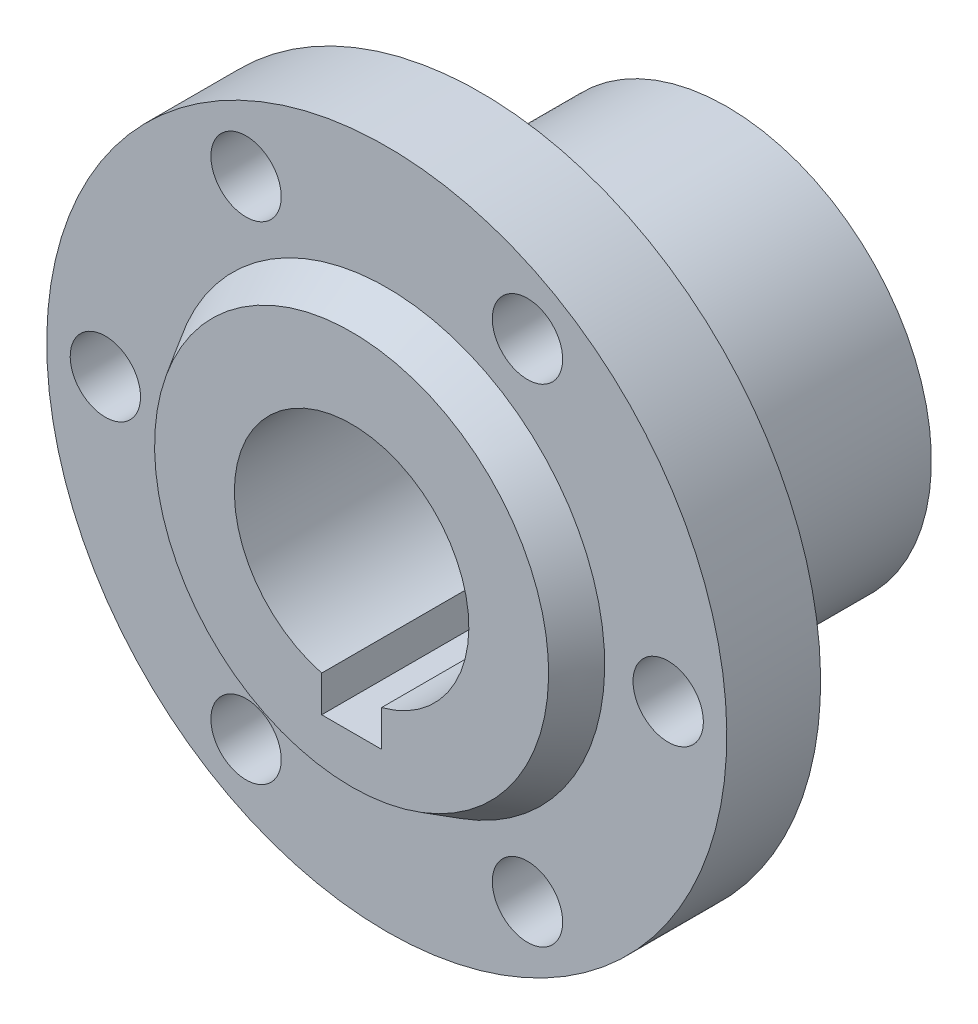
ISO-10303-21;
HEADER;
FILE_DESCRIPTION(('STEP AP214'),'2;1');
FILE_NAME('part.step','',(''),(''),'','','');
FILE_SCHEMA(('AUTOMOTIVE_DESIGN { 1 0 10303 214 1 1 1 1 }'));
ENDSEC;
DATA;
#1=APPLICATION_CONTEXT('core data for automotive mechanical design processes');
#2=APPLICATION_PROTOCOL_DEFINITION('international standard','automotive_design',2000,#1);
#3=PRODUCT_CONTEXT('',#1,'mechanical');
#4=PRODUCT('Part','Part','',(#3));
#5=PRODUCT_RELATED_PRODUCT_CATEGORY('part','',(#4));
#6=PRODUCT_DEFINITION_FORMATION('','',#4);
#7=PRODUCT_DEFINITION_CONTEXT('part definition',#1,'design');
#8=PRODUCT_DEFINITION('design','',#6,#7);
#9=PRODUCT_DEFINITION_SHAPE('','',#8);
#10=(LENGTH_UNIT() NAMED_UNIT(*) SI_UNIT(.MILLI.,.METRE.));
#11=(NAMED_UNIT(*) PLANE_ANGLE_UNIT() SI_UNIT($,.RADIAN.));
#12=(NAMED_UNIT(*) SI_UNIT($,.STERADIAN.) SOLID_ANGLE_UNIT());
#13=UNCERTAINTY_MEASURE_WITH_UNIT(LENGTH_MEASURE(1.E-05),#10,'distance_accuracy_value','');
#14=(GEOMETRIC_REPRESENTATION_CONTEXT(3) GLOBAL_UNCERTAINTY_ASSIGNED_CONTEXT((#13)) GLOBAL_UNIT_ASSIGNED_CONTEXT((#10,
#11,#12)) REPRESENTATION_CONTEXT('',''));
#15=CARTESIAN_POINT('',(0.,0.,0.));
#16=DIRECTION('',(0.,0.,1.));
#17=DIRECTION('',(1.,0.,0.));
#18=AXIS2_PLACEMENT_3D('',#15,#16,#17);
#19=CARTESIAN_POINT('',(0.,10.,-21.));
#20=DIRECTION('',(0.,0.,1.));
#21=DIRECTION('',(0.,-1.,0.));
#22=AXIS2_PLACEMENT_3D('',#19,#20,#21);
#23=PLANE('',#22);
#24=CARTESIAN_POINT('',(0.,0.,-21.));
#25=DIRECTION('',(0.,0.,1.));
#26=DIRECTION('',(0.,-1.,0.));
#27=AXIS2_PLACEMENT_3D('',#24,#25,#26);
#28=CIRCLE('',#27,17.45);
#29=CARTESIAN_POINT('',(0.,-17.45,-21.));
#30=VERTEX_POINT('',#29);
#31=EDGE_CURVE('E11',#30,#30,#28,.T.);
#32=ORIENTED_EDGE('',*,*,#31,.F.);
#33=EDGE_LOOP('',(#32));
#34=FACE_BOUND('',#33,.T.);
#35=DIRECTION('',(1.,0.,0.));
#36=VECTOR('',#35,1.);
#37=CARTESIAN_POINT('',(-2.55,-12.75,-21.));
#38=LINE('',#37,#36);
#39=CARTESIAN_POINT('',(-2.55,-12.75,-21.));
#40=VERTEX_POINT('',#39);
#41=CARTESIAN_POINT('',(2.55,-12.75,-21.));
#42=VERTEX_POINT('',#41);
#43=EDGE_CURVE('E159',#40,#42,#38,.T.);
#44=ORIENTED_EDGE('',*,*,#43,.T.);
#45=DIRECTION('',(0.,1.,0.));
#46=VECTOR('',#45,1.);
#47=CARTESIAN_POINT('',(2.55,-12.75,-21.));
#48=LINE('',#47,#46);
#49=CARTESIAN_POINT('',(2.55,-9.66941053012023,-21.));
#50=VERTEX_POINT('',#49);
#51=EDGE_CURVE('E87',#42,#50,#48,.T.);
#52=ORIENTED_EDGE('',*,*,#51,.T.);
#53=CARTESIAN_POINT('',(0.,0.,-21.));
#54=DIRECTION('',(0.,0.,1.));
#55=DIRECTION('',(0.,-1.,0.));
#56=AXIS2_PLACEMENT_3D('',#53,#54,#55);
#57=CIRCLE('',#56,10.);
#58=CARTESIAN_POINT('',(-2.55,-9.66941053012023,-21.));
#59=VERTEX_POINT('',#58);
#60=EDGE_CURVE('E101',#50,#59,#57,.T.);
#61=ORIENTED_EDGE('',*,*,#60,.T.);
#62=DIRECTION('',(0.,-1.,0.));
#63=VECTOR('',#62,1.);
#64=CARTESIAN_POINT('',(-2.55,-12.75,-21.));
#65=LINE('',#64,#63);
#66=EDGE_CURVE('E52',#59,#40,#65,.T.);
#67=ORIENTED_EDGE('',*,*,#66,.T.);
#68=EDGE_LOOP('',(#44,#52,#61,#67));
#69=FACE_BOUND('',#68,.T.);
#70=ADVANCED_FACE('F36',(#34,#69),#23,.F.);
#71=CARTESIAN_POINT('',(0.,0.,11.));
#72=DIRECTION('',(0.,0.,1.));
#73=DIRECTION('',(0.,-1.,0.));
#74=AXIS2_PLACEMENT_3D('',#71,#72,#73);
#75=CYLINDRICAL_SURFACE('',#74,17.45);
#76=CARTESIAN_POINT('',(0.,0.,-7.03));
#77=DIRECTION('',(0.,0.,1.));
#78=DIRECTION('',(0.,-1.,0.));
#79=AXIS2_PLACEMENT_3D('',#76,#77,#78);
#80=CIRCLE('',#79,17.45);
#81=CARTESIAN_POINT('',(0.,-17.45,-7.03));
#82=VERTEX_POINT('',#81);
#83=EDGE_CURVE('E44',#82,#82,#80,.T.);
#84=ORIENTED_EDGE('',*,*,#83,.F.);
#85=EDGE_LOOP('',(#84));
#86=FACE_BOUND('',#85,.T.);
#87=ORIENTED_EDGE('',*,*,#31,.T.);
#88=EDGE_LOOP('',(#87));
#89=FACE_BOUND('',#88,.T.);
#90=ADVANCED_FACE('F181',(#86,#89),#75,.T.);
#91=CARTESIAN_POINT('',(0.,17.45,-7.03));
#92=DIRECTION('',(0.,0.,1.));
#93=DIRECTION('',(0.,-1.,0.));
#94=AXIS2_PLACEMENT_3D('',#91,#92,#93);
#95=PLANE('',#94);
#96=CARTESIAN_POINT('',(0.,0.,-7.03));
#97=DIRECTION('',(0.,0.,1.));
#98=DIRECTION('',(0.,-1.,0.));
#99=AXIS2_PLACEMENT_3D('',#96,#97,#98);
#100=CIRCLE('',#99,18.5);
#101=CARTESIAN_POINT('',(0.,-18.5,-7.03));
#102=VERTEX_POINT('',#101);
#103=EDGE_CURVE('E119',#102,#102,#100,.T.);
#104=ORIENTED_EDGE('',*,*,#103,.F.);
#105=EDGE_LOOP('',(#104));
#106=FACE_BOUND('',#105,.T.);
#107=ORIENTED_EDGE('',*,*,#83,.T.);
#108=EDGE_LOOP('',(#107));
#109=FACE_BOUND('',#108,.T.);
#110=ADVANCED_FACE('F186',(#106,#109),#95,.F.);
#111=CARTESIAN_POINT('',(0.,0.,11.));
#112=DIRECTION('',(0.,0.,1.));
#113=DIRECTION('',(0.,-1.,0.));
#114=AXIS2_PLACEMENT_3D('',#111,#112,#113);
#115=CYLINDRICAL_SURFACE('',#114,18.5);
#116=CARTESIAN_POINT('',(0.,0.,0.));
#117=DIRECTION('',(0.,0.,1.));
#118=DIRECTION('',(0.,-1.,0.));
#119=AXIS2_PLACEMENT_3D('',#116,#117,#118);
#120=CIRCLE('',#119,18.5);
#121=CARTESIAN_POINT('',(0.,-18.5,0.));
#122=VERTEX_POINT('',#121);
#123=EDGE_CURVE('E116',#122,#122,#120,.T.);
#124=ORIENTED_EDGE('',*,*,#123,.F.);
#125=EDGE_LOOP('',(#124));
#126=FACE_BOUND('',#125,.T.);
#127=ORIENTED_EDGE('',*,*,#103,.T.);
#128=EDGE_LOOP('',(#127));
#129=FACE_BOUND('',#128,.T.);
#130=ADVANCED_FACE('F193',(#126,#129),#115,.T.);
#131=CARTESIAN_POINT('',(0.,18.5,0.));
#132=DIRECTION('',(0.,0.,1.));
#133=DIRECTION('',(0.,-1.,0.));
#134=AXIS2_PLACEMENT_3D('',#131,#132,#133);
#135=PLANE('',#134);
#136=CARTESIAN_POINT('',(24.,0.,0.));
#137=DIRECTION('',(0.,0.,1.));
#138=DIRECTION('',(0.,-1.,0.));
#139=AXIS2_PLACEMENT_3D('',#136,#137,#138);
#140=CIRCLE('',#139,2.99999999999999);
#141=CARTESIAN_POINT('',(24.,-2.99999999999999,0.));
#142=VERTEX_POINT('',#141);
#143=EDGE_CURVE('E97',#142,#142,#140,.T.);
#144=ORIENTED_EDGE('',*,*,#143,.T.);
#145=EDGE_LOOP('',(#144));
#146=FACE_BOUND('',#145,.T.);
#147=CARTESIAN_POINT('',(12.,-20.7846096908265,0.));
#148=DIRECTION('',(0.,0.,1.));
#149=DIRECTION('',(0.,-1.,0.));
#150=AXIS2_PLACEMENT_3D('',#147,#148,#149);
#151=CIRCLE('',#150,3.00000000000001);
#152=CARTESIAN_POINT('',(12.,-23.7846096908265,0.));
#153=VERTEX_POINT('',#152);
#154=EDGE_CURVE('E141',#153,#153,#151,.T.);
#155=ORIENTED_EDGE('',*,*,#154,.T.);
#156=EDGE_LOOP('',(#155));
#157=FACE_BOUND('',#156,.T.);
#158=CARTESIAN_POINT('',(-12.,-20.7846096908265,0.));
#159=DIRECTION('',(0.,0.,1.));
#160=DIRECTION('',(0.,-1.,0.));
#161=AXIS2_PLACEMENT_3D('',#158,#159,#160);
#162=CIRCLE('',#161,3.00000000000001);
#163=CARTESIAN_POINT('',(-12.,-23.7846096908265,0.));
#164=VERTEX_POINT('',#163);
#165=EDGE_CURVE('E138',#164,#164,#162,.T.);
#166=ORIENTED_EDGE('',*,*,#165,.T.);
#167=EDGE_LOOP('',(#166));
#168=FACE_BOUND('',#167,.T.);
#169=CARTESIAN_POINT('',(-24.,0.,0.));
#170=DIRECTION('',(0.,0.,1.));
#171=DIRECTION('',(0.,-1.,0.));
#172=AXIS2_PLACEMENT_3D('',#169,#170,#171);
#173=CIRCLE('',#172,2.99999999999999);
#174=CARTESIAN_POINT('',(-24.,-2.99999999999999,0.));
#175=VERTEX_POINT('',#174);
#176=EDGE_CURVE('E135',#175,#175,#173,.T.);
#177=ORIENTED_EDGE('',*,*,#176,.T.);
#178=EDGE_LOOP('',(#177));
#179=FACE_BOUND('',#178,.T.);
#180=CARTESIAN_POINT('',(-12.,20.7846096908265,0.));
#181=DIRECTION('',(0.,0.,1.));
#182=DIRECTION('',(0.,-1.,0.));
#183=AXIS2_PLACEMENT_3D('',#180,#181,#182);
#184=CIRCLE('',#183,3.00000000000001);
#185=CARTESIAN_POINT('',(-12.,17.7846096908265,0.));
#186=VERTEX_POINT('',#185);
#187=EDGE_CURVE('E131',#186,#186,#184,.T.);
#188=ORIENTED_EDGE('',*,*,#187,.T.);
#189=EDGE_LOOP('',(#188));
#190=FACE_BOUND('',#189,.T.);
#191=CARTESIAN_POINT('',(12.,20.7846096908265,0.));
#192=DIRECTION('',(0.,0.,1.));
#193=DIRECTION('',(0.,-1.,0.));
#194=AXIS2_PLACEMENT_3D('',#191,#192,#193);
#195=CIRCLE('',#194,3.00000000000001);
#196=CARTESIAN_POINT('',(12.,17.7846096908265,0.));
#197=VERTEX_POINT('',#196);
#198=EDGE_CURVE('E127',#197,#197,#195,.T.);
#199=ORIENTED_EDGE('',*,*,#198,.T.);
#200=EDGE_LOOP('',(#199));
#201=FACE_BOUND('',#200,.T.);
#202=CARTESIAN_POINT('',(0.,0.,0.));
#203=DIRECTION('',(0.,0.,1.));
#204=DIRECTION('',(0.,-1.,0.));
#205=AXIS2_PLACEMENT_3D('',#202,#203,#204);
#206=CIRCLE('',#205,29.);
#207=CARTESIAN_POINT('',(0.,-29.,0.));
#208=VERTEX_POINT('',#207);
#209=EDGE_CURVE('E113',#208,#208,#206,.T.);
#210=ORIENTED_EDGE('',*,*,#209,.F.);
#211=EDGE_LOOP('',(#210));
#212=FACE_BOUND('',#211,.T.);
#213=ORIENTED_EDGE('',*,*,#123,.T.);
#214=EDGE_LOOP('',(#213));
#215=FACE_BOUND('',#214,.T.);
#216=ADVANCED_FACE('F200',(#146,#157,#168,#179,#190,#201,#212,#215),#135,.F.);
#217=CARTESIAN_POINT('',(0.,0.,11.));
#218=DIRECTION('',(0.,0.,1.));
#219=DIRECTION('',(0.,-1.,0.));
#220=AXIS2_PLACEMENT_3D('',#217,#218,#219);
#221=CYLINDRICAL_SURFACE('',#220,29.);
#222=CARTESIAN_POINT('',(0.,0.,8.));
#223=DIRECTION('',(0.,0.,1.));
#224=DIRECTION('',(0.,-1.,0.));
#225=AXIS2_PLACEMENT_3D('',#222,#223,#224);
#226=CIRCLE('',#225,29.);
#227=CARTESIAN_POINT('',(0.,-29.,8.00000000000001));
#228=VERTEX_POINT('',#227);
#229=EDGE_CURVE('E110',#228,#228,#226,.T.);
#230=ORIENTED_EDGE('',*,*,#229,.F.);
#231=EDGE_LOOP('',(#230));
#232=FACE_BOUND('',#231,.T.);
#233=ORIENTED_EDGE('',*,*,#209,.T.);
#234=EDGE_LOOP('',(#233));
#235=FACE_BOUND('',#234,.T.);
#236=ADVANCED_FACE('F204',(#232,#235),#221,.T.);
#237=CARTESIAN_POINT('',(0.,29.,8.));
#238=DIRECTION('',(0.,0.,-1.));
#239=DIRECTION('',(0.,1.,0.));
#240=AXIS2_PLACEMENT_3D('',#237,#238,#239);
#241=PLANE('',#240);
#242=CARTESIAN_POINT('',(24.,0.,8.));
#243=DIRECTION('',(0.,0.,-1.));
#244=DIRECTION('',(0.,1.,0.));
#245=AXIS2_PLACEMENT_3D('',#242,#243,#244);
#246=CIRCLE('',#245,2.99999999999999);
#247=CARTESIAN_POINT('',(24.,2.99999999999999,8.));
#248=VERTEX_POINT('',#247);
#249=EDGE_CURVE('E39',#248,#248,#246,.T.);
#250=ORIENTED_EDGE('',*,*,#249,.T.);
#251=EDGE_LOOP('',(#250));
#252=FACE_BOUND('',#251,.T.);
#253=CARTESIAN_POINT('',(12.,-20.7846096908265,8.));
#254=DIRECTION('',(0.,0.,-1.));
#255=DIRECTION('',(0.,1.,0.));
#256=AXIS2_PLACEMENT_3D('',#253,#254,#255);
#257=CIRCLE('',#256,3.00000000000001);
#258=CARTESIAN_POINT('',(12.,-17.7846096908265,8.));
#259=VERTEX_POINT('',#258);
#260=EDGE_CURVE('E139',#259,#259,#257,.T.);
#261=ORIENTED_EDGE('',*,*,#260,.T.);
#262=EDGE_LOOP('',(#261));
#263=FACE_BOUND('',#262,.T.);
#264=CARTESIAN_POINT('',(-12.,-20.7846096908265,8.));
#265=DIRECTION('',(0.,0.,-1.));
#266=DIRECTION('',(0.,1.,0.));
#267=AXIS2_PLACEMENT_3D('',#264,#265,#266);
#268=CIRCLE('',#267,3.00000000000001);
#269=CARTESIAN_POINT('',(-12.,-17.7846096908265,8.));
#270=VERTEX_POINT('',#269);
#271=EDGE_CURVE('E136',#270,#270,#268,.T.);
#272=ORIENTED_EDGE('',*,*,#271,.T.);
#273=EDGE_LOOP('',(#272));
#274=FACE_BOUND('',#273,.T.);
#275=CARTESIAN_POINT('',(-24.,0.,8.));
#276=DIRECTION('',(0.,0.,-1.));
#277=DIRECTION('',(0.,1.,0.));
#278=AXIS2_PLACEMENT_3D('',#275,#276,#277);
#279=CIRCLE('',#278,2.99999999999999);
#280=CARTESIAN_POINT('',(-24.,3.,8.));
#281=VERTEX_POINT('',#280);
#282=EDGE_CURVE('E132',#281,#281,#279,.T.);
#283=ORIENTED_EDGE('',*,*,#282,.T.);
#284=EDGE_LOOP('',(#283));
#285=FACE_BOUND('',#284,.T.);
#286=CARTESIAN_POINT('',(-12.,20.7846096908265,8.));
#287=DIRECTION('',(0.,0.,-1.));
#288=DIRECTION('',(0.,1.,0.));
#289=AXIS2_PLACEMENT_3D('',#286,#287,#288);
#290=CIRCLE('',#289,3.00000000000001);
#291=CARTESIAN_POINT('',(-12.,23.7846096908265,8.));
#292=VERTEX_POINT('',#291);
#293=EDGE_CURVE('E128',#292,#292,#290,.T.);
#294=ORIENTED_EDGE('',*,*,#293,.T.);
#295=EDGE_LOOP('',(#294));
#296=FACE_BOUND('',#295,.T.);
#297=CARTESIAN_POINT('',(12.,20.7846096908265,8.));
#298=DIRECTION('',(0.,0.,-1.));
#299=DIRECTION('',(0.,1.,0.));
#300=AXIS2_PLACEMENT_3D('',#297,#298,#299);
#301=CIRCLE('',#300,3.00000000000001);
#302=CARTESIAN_POINT('',(12.,23.7846096908265,8.));
#303=VERTEX_POINT('',#302);
#304=EDGE_CURVE('E124',#303,#303,#301,.T.);
#305=ORIENTED_EDGE('',*,*,#304,.T.);
#306=EDGE_LOOP('',(#305));
#307=FACE_BOUND('',#306,.T.);
#308=CARTESIAN_POINT('',(0.,0.,8.));
#309=DIRECTION('',(0.,0.,1.));
#310=DIRECTION('',(0.,-1.,0.));
#311=AXIS2_PLACEMENT_3D('',#308,#309,#310);
#312=CIRCLE('',#311,18.5862350540226);
#313=CARTESIAN_POINT('',(0.,-18.5862350540226,8.));
#314=VERTEX_POINT('',#313);
#315=EDGE_CURVE('E104',#314,#314,#312,.T.);
#316=ORIENTED_EDGE('',*,*,#315,.F.);
#317=EDGE_LOOP('',(#316));
#318=FACE_BOUND('',#317,.T.);
#319=ORIENTED_EDGE('',*,*,#229,.T.);
#320=EDGE_LOOP('',(#319));
#321=FACE_BOUND('',#320,.T.);
#322=ADVANCED_FACE('F208',(#252,#263,#274,#285,#296,#307,#318,#321),#241,.F.);
#323=CARTESIAN_POINT('',(0.,0.,8.));
#324=DIRECTION('',(0.,0.,-1.));
#325=DIRECTION('',(0.,1.,0.));
#326=AXIS2_PLACEMENT_3D('',#323,#324,#325);
#327=CONICAL_SURFACE('',#326,18.5862350540226,0.536247023308468);
#328=CARTESIAN_POINT('',(0.,0.,11.));
#329=DIRECTION('',(0.,0.,1.));
#330=DIRECTION('',(0.,-1.,0.));
#331=AXIS2_PLACEMENT_3D('',#328,#329,#330);
#332=CIRCLE('',#331,16.8032163461437);
#333=CARTESIAN_POINT('',(0.,-16.8032163461437,11.));
#334=VERTEX_POINT('',#333);
#335=EDGE_CURVE('E100',#334,#334,#332,.T.);
#336=ORIENTED_EDGE('',*,*,#335,.F.);
#337=EDGE_LOOP('',(#336));
#338=FACE_BOUND('',#337,.T.);
#339=ORIENTED_EDGE('',*,*,#315,.T.);
#340=EDGE_LOOP('',(#339));
#341=FACE_BOUND('',#340,.T.);
#342=ADVANCED_FACE('F212',(#338,#341),#327,.T.);
#343=CARTESIAN_POINT('',(0.,10.,11.));
#344=DIRECTION('',(0.,0.,-1.));
#345=DIRECTION('',(0.,1.,0.));
#346=AXIS2_PLACEMENT_3D('',#343,#344,#345);
#347=PLANE('',#346);
#348=CARTESIAN_POINT('',(0.,0.,11.));
#349=DIRECTION('',(0.,0.,1.));
#350=DIRECTION('',(0.,-1.,0.));
#351=AXIS2_PLACEMENT_3D('',#348,#349,#350);
#352=CIRCLE('',#351,10.);
#353=CARTESIAN_POINT('',(2.55,-9.66941053012023,11.));
#354=VERTEX_POINT('',#353);
#355=CARTESIAN_POINT('',(-2.55,-9.66941053012023,11.));
#356=VERTEX_POINT('',#355);
#357=EDGE_CURVE('E94',#354,#356,#352,.T.);
#358=ORIENTED_EDGE('',*,*,#357,.F.);
#359=DIRECTION('',(0.,1.,0.));
#360=VECTOR('',#359,1.);
#361=CARTESIAN_POINT('',(2.55,-12.75,11.));
#362=LINE('',#361,#360);
#363=CARTESIAN_POINT('',(2.55,-12.75,11.));
#364=VERTEX_POINT('',#363);
#365=EDGE_CURVE('E156',#364,#354,#362,.T.);
#366=ORIENTED_EDGE('',*,*,#365,.F.);
#367=DIRECTION('',(1.,0.,0.));
#368=VECTOR('',#367,1.);
#369=CARTESIAN_POINT('',(-2.55,-12.75,11.));
#370=LINE('',#369,#368);
#371=CARTESIAN_POINT('',(-2.55,-12.75,11.));
#372=VERTEX_POINT('',#371);
#373=EDGE_CURVE('E96',#372,#364,#370,.T.);
#374=ORIENTED_EDGE('',*,*,#373,.F.);
#375=DIRECTION('',(0.,-1.,0.));
#376=VECTOR('',#375,1.);
#377=CARTESIAN_POINT('',(-2.55,-12.75,11.));
#378=LINE('',#377,#376);
#379=EDGE_CURVE('E80',#356,#372,#378,.T.);
#380=ORIENTED_EDGE('',*,*,#379,.F.);
#381=EDGE_LOOP('',(#358,#366,#374,#380));
#382=FACE_BOUND('',#381,.T.);
#383=ORIENTED_EDGE('',*,*,#335,.T.);
#384=EDGE_LOOP('',(#383));
#385=FACE_BOUND('',#384,.T.);
#386=ADVANCED_FACE('F91',(#382,#385),#347,.F.);
#387=CARTESIAN_POINT('',(0.,0.,11.));
#388=DIRECTION('',(0.,0.,1.));
#389=DIRECTION('',(0.,-1.,0.));
#390=AXIS2_PLACEMENT_3D('',#387,#388,#389);
#391=CYLINDRICAL_SURFACE('',#390,10.);
#392=ORIENTED_EDGE('',*,*,#60,.F.);
#393=DIRECTION('',(0.,0.,1.));
#394=VECTOR('',#393,1.);
#395=CARTESIAN_POINT('',(2.55,-9.66941053012023,-21.));
#396=LINE('',#395,#394);
#397=EDGE_CURVE('E60',#50,#354,#396,.T.);
#398=ORIENTED_EDGE('',*,*,#397,.T.);
#399=ORIENTED_EDGE('',*,*,#357,.T.);
#400=DIRECTION('',(0.,0.,1.));
#401=VECTOR('',#400,1.);
#402=CARTESIAN_POINT('',(-2.55,-9.66941053012023,-21.));
#403=LINE('',#402,#401);
#404=EDGE_CURVE('E77',#59,#356,#403,.T.);
#405=ORIENTED_EDGE('',*,*,#404,.F.);
#406=EDGE_LOOP('',(#392,#398,#399,#405));
#407=FACE_BOUND('',#406,.T.);
#408=ADVANCED_FACE('F99',(#407),#391,.F.);
#409=CARTESIAN_POINT('',(2.55,-12.75,-21.));
#410=DIRECTION('',(1.,0.,0.));
#411=DIRECTION('',(0.,1.,0.));
#412=AXIS2_PLACEMENT_3D('',#409,#410,#411);
#413=PLANE('',#412);
#414=ORIENTED_EDGE('',*,*,#397,.F.);
#415=ORIENTED_EDGE('',*,*,#51,.F.);
#416=DIRECTION('',(0.,0.,1.));
#417=VECTOR('',#416,1.);
#418=CARTESIAN_POINT('',(2.55,-12.75,-21.));
#419=LINE('',#418,#417);
#420=EDGE_CURVE('E164',#42,#364,#419,.T.);
#421=ORIENTED_EDGE('',*,*,#420,.T.);
#422=ORIENTED_EDGE('',*,*,#365,.T.);
#423=EDGE_LOOP('',(#414,#415,#421,#422));
#424=FACE_BOUND('',#423,.T.);
#425=ADVANCED_FACE('F170',(#424),#413,.F.);
#426=CARTESIAN_POINT('',(-2.55,-12.75,-21.));
#427=DIRECTION('',(0.,-1.,0.));
#428=DIRECTION('',(0.,0.,-1.));
#429=AXIS2_PLACEMENT_3D('',#426,#427,#428);
#430=PLANE('',#429);
#431=ORIENTED_EDGE('',*,*,#420,.F.);
#432=ORIENTED_EDGE('',*,*,#43,.F.);
#433=DIRECTION('',(0.,0.,1.));
#434=VECTOR('',#433,1.);
#435=CARTESIAN_POINT('',(-2.55,-12.75,-21.));
#436=LINE('',#435,#434);
#437=EDGE_CURVE('E86',#40,#372,#436,.T.);
#438=ORIENTED_EDGE('',*,*,#437,.T.);
#439=ORIENTED_EDGE('',*,*,#373,.T.);
#440=EDGE_LOOP('',(#431,#432,#438,#439));
#441=FACE_BOUND('',#440,.T.);
#442=ADVANCED_FACE('F168',(#441),#430,.F.);
#443=CARTESIAN_POINT('',(-2.55,-12.75,-21.));
#444=DIRECTION('',(-1.,0.,0.));
#445=DIRECTION('',(0.,-1.,0.));
#446=AXIS2_PLACEMENT_3D('',#443,#444,#445);
#447=PLANE('',#446);
#448=ORIENTED_EDGE('',*,*,#437,.F.);
#449=ORIENTED_EDGE('',*,*,#66,.F.);
#450=ORIENTED_EDGE('',*,*,#404,.T.);
#451=ORIENTED_EDGE('',*,*,#379,.T.);
#452=EDGE_LOOP('',(#448,#449,#450,#451));
#453=FACE_BOUND('',#452,.T.);
#454=ADVANCED_FACE('F79',(#453),#447,.F.);
#455=CARTESIAN_POINT('',(12.,20.7846096908265,11.));
#456=DIRECTION('',(0.,0.,-1.));
#457=DIRECTION('',(0.,1.,0.));
#458=AXIS2_PLACEMENT_3D('',#455,#456,#457);
#459=CYLINDRICAL_SURFACE('',#458,3.00000000000001);
#460=ORIENTED_EDGE('',*,*,#304,.F.);
#461=EDGE_LOOP('',(#460));
#462=FACE_BOUND('',#461,.T.);
#463=ORIENTED_EDGE('',*,*,#198,.F.);
#464=EDGE_LOOP('',(#463));
#465=FACE_BOUND('',#464,.T.);
#466=ADVANCED_FACE('F220',(#462,#465),#459,.F.);
#467=CARTESIAN_POINT('',(-12.,20.7846096908265,11.));
#468=DIRECTION('',(0.,0.,-1.));
#469=DIRECTION('',(0.,1.,0.));
#470=AXIS2_PLACEMENT_3D('',#467,#468,#469);
#471=CYLINDRICAL_SURFACE('',#470,3.00000000000001);
#472=ORIENTED_EDGE('',*,*,#293,.F.);
#473=EDGE_LOOP('',(#472));
#474=FACE_BOUND('',#473,.T.);
#475=ORIENTED_EDGE('',*,*,#187,.F.);
#476=EDGE_LOOP('',(#475));
#477=FACE_BOUND('',#476,.T.);
#478=ADVANCED_FACE('F224',(#474,#477),#471,.F.);
#479=CARTESIAN_POINT('',(-24.,0.,11.));
#480=DIRECTION('',(0.,0.,-1.));
#481=DIRECTION('',(0.,1.,0.));
#482=AXIS2_PLACEMENT_3D('',#479,#480,#481);
#483=CYLINDRICAL_SURFACE('',#482,2.99999999999999);
#484=ORIENTED_EDGE('',*,*,#282,.F.);
#485=EDGE_LOOP('',(#484));
#486=FACE_BOUND('',#485,.T.);
#487=ORIENTED_EDGE('',*,*,#176,.F.);
#488=EDGE_LOOP('',(#487));
#489=FACE_BOUND('',#488,.T.);
#490=ADVANCED_FACE('F230',(#486,#489),#483,.F.);
#491=CARTESIAN_POINT('',(-12.,-20.7846096908265,11.));
#492=DIRECTION('',(0.,0.,-1.));
#493=DIRECTION('',(0.,1.,0.));
#494=AXIS2_PLACEMENT_3D('',#491,#492,#493);
#495=CYLINDRICAL_SURFACE('',#494,3.00000000000001);
#496=ORIENTED_EDGE('',*,*,#271,.F.);
#497=EDGE_LOOP('',(#496));
#498=FACE_BOUND('',#497,.T.);
#499=ORIENTED_EDGE('',*,*,#165,.F.);
#500=EDGE_LOOP('',(#499));
#501=FACE_BOUND('',#500,.T.);
#502=ADVANCED_FACE('F240',(#498,#501),#495,.F.);
#503=CARTESIAN_POINT('',(12.,-20.7846096908265,11.));
#504=DIRECTION('',(0.,0.,-1.));
#505=DIRECTION('',(0.,1.,0.));
#506=AXIS2_PLACEMENT_3D('',#503,#504,#505);
#507=CYLINDRICAL_SURFACE('',#506,3.00000000000001);
#508=ORIENTED_EDGE('',*,*,#260,.F.);
#509=EDGE_LOOP('',(#508));
#510=FACE_BOUND('',#509,.T.);
#511=ORIENTED_EDGE('',*,*,#154,.F.);
#512=EDGE_LOOP('',(#511));
#513=FACE_BOUND('',#512,.T.);
#514=ADVANCED_FACE('F236',(#510,#513),#507,.F.);
#515=CARTESIAN_POINT('',(24.,0.,11.));
#516=DIRECTION('',(0.,0.,-1.));
#517=DIRECTION('',(0.,1.,0.));
#518=AXIS2_PLACEMENT_3D('',#515,#516,#517);
#519=CYLINDRICAL_SURFACE('',#518,2.99999999999999);
#520=ORIENTED_EDGE('',*,*,#249,.F.);
#521=EDGE_LOOP('',(#520));
#522=FACE_BOUND('',#521,.T.);
#523=ORIENTED_EDGE('',*,*,#143,.F.);
#524=EDGE_LOOP('',(#523));
#525=FACE_BOUND('',#524,.T.);
#526=ADVANCED_FACE('F247',(#522,#525),#519,.F.);
#527=CLOSED_SHELL('',(#70,#90,#110,#130,#216,#236,#322,#342,#386,#408,#425,#442,#454,#466,#478,
#490,#502,#514,#526));
#528=MANIFOLD_SOLID_BREP('B2',#527);
#529=ADVANCED_BREP_SHAPE_REPRESENTATION('',(#18,#528),#14);
#530=SHAPE_DEFINITION_REPRESENTATION(#9,#529);
ENDSEC;
END-ISO-10303-21;
